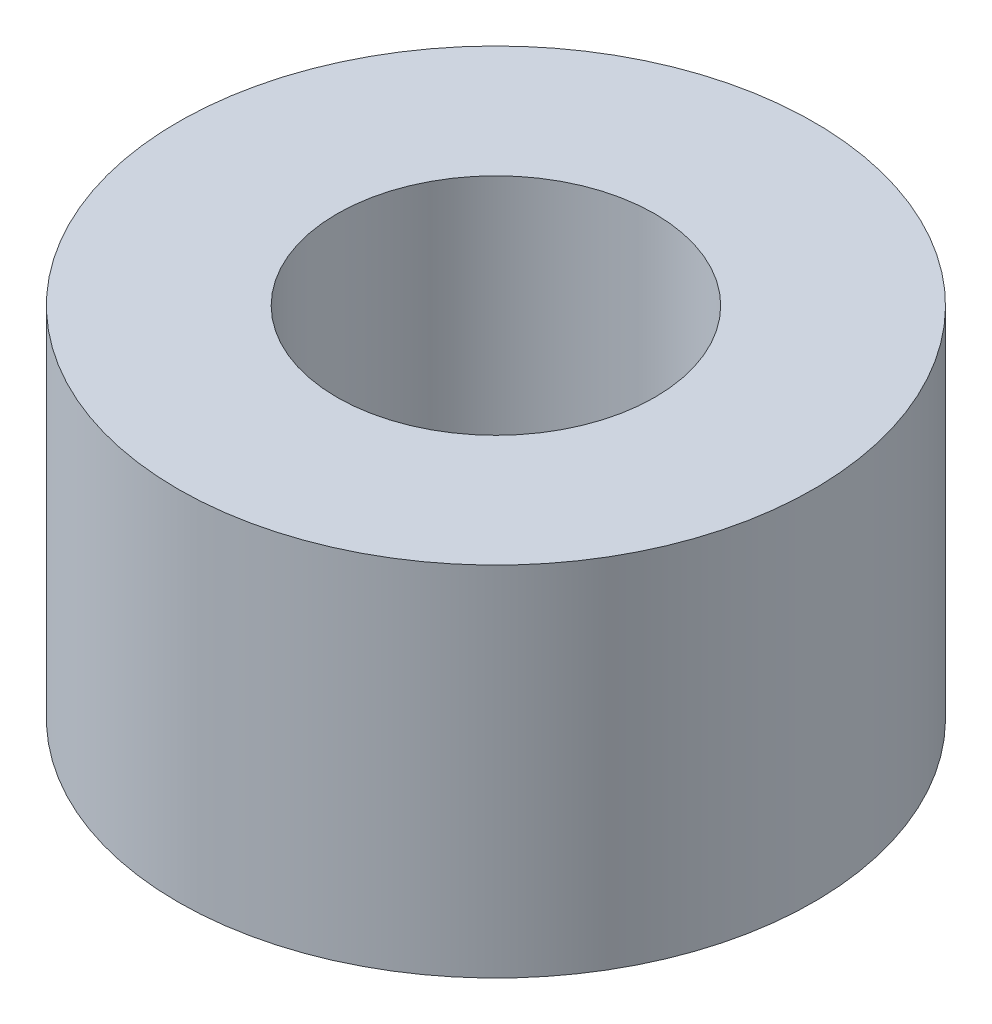
ISO-10303-21;
HEADER;
FILE_DESCRIPTION(('STEP AP214'),'2;1');
FILE_NAME('part.step','',(''),(''),'','','');
FILE_SCHEMA(('AUTOMOTIVE_DESIGN { 1 0 10303 214 1 1 1 1 }'));
ENDSEC;
DATA;
#1=APPLICATION_CONTEXT('core data for automotive mechanical design processes');
#2=APPLICATION_PROTOCOL_DEFINITION('international standard','automotive_design',2000,#1);
#3=PRODUCT_CONTEXT('',#1,'mechanical');
#4=PRODUCT('Part','Part','',(#3));
#5=PRODUCT_RELATED_PRODUCT_CATEGORY('part','',(#4));
#6=PRODUCT_DEFINITION_FORMATION('','',#4);
#7=PRODUCT_DEFINITION_CONTEXT('part definition',#1,'design');
#8=PRODUCT_DEFINITION('design','',#6,#7);
#9=PRODUCT_DEFINITION_SHAPE('','',#8);
#10=(LENGTH_UNIT() NAMED_UNIT(*) SI_UNIT(.MILLI.,.METRE.));
#11=(NAMED_UNIT(*) PLANE_ANGLE_UNIT() SI_UNIT($,.RADIAN.));
#12=(NAMED_UNIT(*) SI_UNIT($,.STERADIAN.) SOLID_ANGLE_UNIT());
#13=UNCERTAINTY_MEASURE_WITH_UNIT(LENGTH_MEASURE(1.E-05),#10,'distance_accuracy_value','');
#14=(GEOMETRIC_REPRESENTATION_CONTEXT(3) GLOBAL_UNCERTAINTY_ASSIGNED_CONTEXT((#13)) GLOBAL_UNIT_ASSIGNED_CONTEXT((#10,
#11,#12)) REPRESENTATION_CONTEXT('',''));
#15=CARTESIAN_POINT('',(0.,0.,0.));
#16=DIRECTION('',(0.,0.,1.));
#17=DIRECTION('',(1.,0.,0.));
#18=AXIS2_PLACEMENT_3D('',#15,#16,#17);
#19=CARTESIAN_POINT('',(0.,4.5,0.));
#20=DIRECTION('',(0.,1.,0.));
#21=DIRECTION('',(0.,0.,1.));
#22=AXIS2_PLACEMENT_3D('',#19,#20,#21);
#23=PLANE('',#22);
#24=CARTESIAN_POINT('',(0.,4.5,0.));
#25=DIRECTION('',(0.,1.,0.));
#26=DIRECTION('',(0.,0.,1.));
#27=AXIS2_PLACEMENT_3D('',#24,#25,#26);
#28=CIRCLE('',#27,4.);
#29=CARTESIAN_POINT('',(0.,4.5,4.));
#30=VERTEX_POINT('',#29);
#31=EDGE_CURVE('E10',#30,#30,#28,.T.);
#32=ORIENTED_EDGE('',*,*,#31,.T.);
#33=EDGE_LOOP('',(#32));
#34=FACE_BOUND('',#33,.T.);
#35=CARTESIAN_POINT('',(0.,4.5,0.));
#36=DIRECTION('',(0.,1.,0.));
#37=DIRECTION('',(0.,0.,1.));
#38=AXIS2_PLACEMENT_3D('',#35,#36,#37);
#39=CIRCLE('',#38,2.);
#40=CARTESIAN_POINT('',(0.,4.5,2.));
#41=VERTEX_POINT('',#40);
#42=EDGE_CURVE('E46',#41,#41,#39,.T.);
#43=ORIENTED_EDGE('',*,*,#42,.F.);
#44=EDGE_LOOP('',(#43));
#45=FACE_BOUND('',#44,.T.);
#46=ADVANCED_FACE('F35',(#34,#45),#23,.T.);
#47=CARTESIAN_POINT('',(0.,0.,0.));
#48=DIRECTION('',(0.,1.,0.));
#49=DIRECTION('',(0.,0.,1.));
#50=AXIS2_PLACEMENT_3D('',#47,#48,#49);
#51=PLANE('',#50);
#52=CARTESIAN_POINT('',(0.,0.,0.));
#53=DIRECTION('',(0.,1.,0.));
#54=DIRECTION('',(0.,0.,1.));
#55=AXIS2_PLACEMENT_3D('',#52,#53,#54);
#56=CIRCLE('',#55,4.);
#57=CARTESIAN_POINT('',(0.,0.,4.));
#58=VERTEX_POINT('',#57);
#59=EDGE_CURVE('E39',#58,#58,#56,.T.);
#60=ORIENTED_EDGE('',*,*,#59,.F.);
#61=EDGE_LOOP('',(#60));
#62=FACE_BOUND('',#61,.T.);
#63=CARTESIAN_POINT('',(0.,0.,0.));
#64=DIRECTION('',(0.,1.,0.));
#65=DIRECTION('',(0.,0.,1.));
#66=AXIS2_PLACEMENT_3D('',#63,#64,#65);
#67=CIRCLE('',#66,2.);
#68=CARTESIAN_POINT('',(0.,0.,2.));
#69=VERTEX_POINT('',#68);
#70=EDGE_CURVE('E48',#69,#69,#67,.T.);
#71=ORIENTED_EDGE('',*,*,#70,.T.);
#72=EDGE_LOOP('',(#71));
#73=FACE_BOUND('',#72,.T.);
#74=ADVANCED_FACE('F58',(#62,#73),#51,.F.);
#75=CARTESIAN_POINT('',(0.,4.5,0.));
#76=DIRECTION('',(0.,-1.,0.));
#77=DIRECTION('',(0.,0.,-1.));
#78=AXIS2_PLACEMENT_3D('',#75,#76,#77);
#79=CYLINDRICAL_SURFACE('',#78,4.);
#80=ORIENTED_EDGE('',*,*,#31,.F.);
#81=EDGE_LOOP('',(#80));
#82=FACE_BOUND('',#81,.T.);
#83=ORIENTED_EDGE('',*,*,#59,.T.);
#84=EDGE_LOOP('',(#83));
#85=FACE_BOUND('',#84,.T.);
#86=ADVANCED_FACE('F37',(#82,#85),#79,.T.);
#87=CARTESIAN_POINT('',(0.,4.5,0.));
#88=DIRECTION('',(0.,-1.,0.));
#89=DIRECTION('',(0.,0.,-1.));
#90=AXIS2_PLACEMENT_3D('',#87,#88,#89);
#91=CYLINDRICAL_SURFACE('',#90,2.);
#92=ORIENTED_EDGE('',*,*,#42,.T.);
#93=EDGE_LOOP('',(#92));
#94=FACE_BOUND('',#93,.T.);
#95=ORIENTED_EDGE('',*,*,#70,.F.);
#96=EDGE_LOOP('',(#95));
#97=FACE_BOUND('',#96,.T.);
#98=ADVANCED_FACE('F54',(#94,#97),#91,.F.);
#99=CLOSED_SHELL('',(#46,#74,#86,#98));
#100=MANIFOLD_SOLID_BREP('B2',#99);
#101=ADVANCED_BREP_SHAPE_REPRESENTATION('',(#18,#100),#14);
#102=SHAPE_DEFINITION_REPRESENTATION(#9,#101);
ENDSEC;
END-ISO-10303-21;
